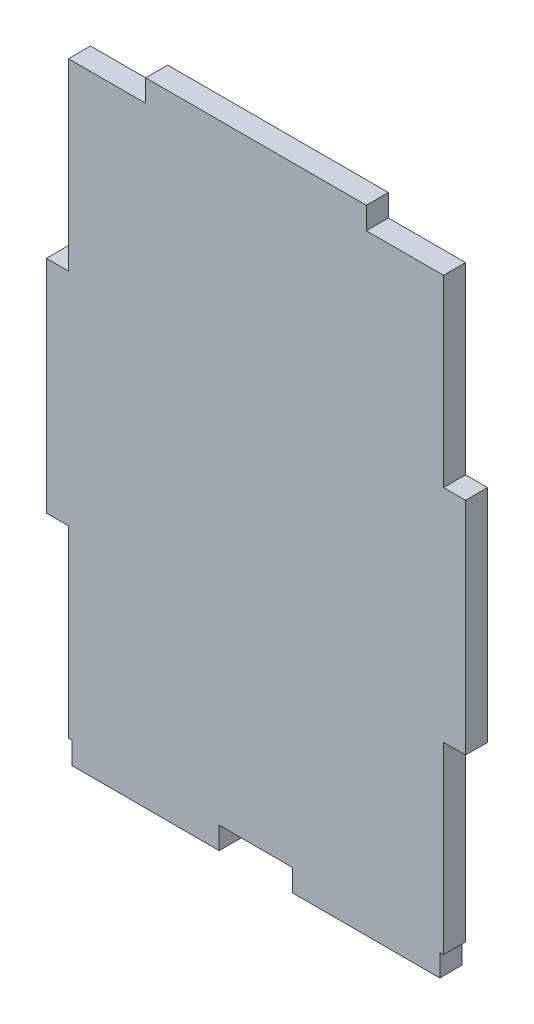
ISO-10303-21;
HEADER;
FILE_DESCRIPTION(('STEP AP214'),'2;1');
FILE_NAME('part.step','',(''),(''),'','','');
FILE_SCHEMA(('AUTOMOTIVE_DESIGN { 1 0 10303 214 1 1 1 1 }'));
ENDSEC;
DATA;
#1=APPLICATION_CONTEXT('core data for automotive mechanical design processes');
#2=APPLICATION_PROTOCOL_DEFINITION('international standard','automotive_design',2000,#1);
#3=PRODUCT_CONTEXT('',#1,'mechanical');
#4=PRODUCT('Part','Part','',(#3));
#5=PRODUCT_RELATED_PRODUCT_CATEGORY('part','',(#4));
#6=PRODUCT_DEFINITION_FORMATION('','',#4);
#7=PRODUCT_DEFINITION_CONTEXT('part definition',#1,'design');
#8=PRODUCT_DEFINITION('design','',#6,#7);
#9=PRODUCT_DEFINITION_SHAPE('','',#8);
#10=(LENGTH_UNIT() NAMED_UNIT(*) SI_UNIT(.MILLI.,.METRE.));
#11=(NAMED_UNIT(*) PLANE_ANGLE_UNIT() SI_UNIT($,.RADIAN.));
#12=(NAMED_UNIT(*) SI_UNIT($,.STERADIAN.) SOLID_ANGLE_UNIT());
#13=UNCERTAINTY_MEASURE_WITH_UNIT(LENGTH_MEASURE(1.E-05),#10,'distance_accuracy_value','');
#14=(GEOMETRIC_REPRESENTATION_CONTEXT(3) GLOBAL_UNCERTAINTY_ASSIGNED_CONTEXT((#13)) GLOBAL_UNIT_ASSIGNED_CONTEXT((#10,
#11,#12)) REPRESENTATION_CONTEXT('',''));
#15=CARTESIAN_POINT('',(0.,0.,0.));
#16=DIRECTION('',(0.,0.,1.));
#17=DIRECTION('',(1.,0.,0.));
#18=AXIS2_PLACEMENT_3D('',#15,#16,#17);
#19=CARTESIAN_POINT('',(25.5,15.,1.5));
#20=DIRECTION('',(-1.,0.,0.));
#21=DIRECTION('',(0.,0.,1.));
#22=AXIS2_PLACEMENT_3D('',#19,#20,#21);
#23=PLANE('',#22);
#24=DIRECTION('',(0.,1.,0.));
#25=VECTOR('',#24,1.);
#26=CARTESIAN_POINT('',(25.5,15.,-1.5));
#27=LINE('',#26,#25);
#28=CARTESIAN_POINT('',(25.5,15.,-1.5));
#29=VERTEX_POINT('',#28);
#30=CARTESIAN_POINT('',(25.5,40.,-1.5));
#31=VERTEX_POINT('',#30);
#32=EDGE_CURVE('E225',#29,#31,#27,.T.);
#33=ORIENTED_EDGE('',*,*,#32,.T.);
#34=DIRECTION('',(0.,0.,-1.));
#35=VECTOR('',#34,1.);
#36=CARTESIAN_POINT('',(25.5,40.,1.5));
#37=LINE('',#36,#35);
#38=CARTESIAN_POINT('',(25.5,40.,1.5));
#39=VERTEX_POINT('',#38);
#40=EDGE_CURVE('E11',#39,#31,#37,.T.);
#41=ORIENTED_EDGE('',*,*,#40,.F.);
#42=DIRECTION('',(0.,1.,0.));
#43=VECTOR('',#42,1.);
#44=CARTESIAN_POINT('',(25.5,15.,1.5));
#45=LINE('',#44,#43);
#46=CARTESIAN_POINT('',(25.5,15.,1.5));
#47=VERTEX_POINT('',#46);
#48=EDGE_CURVE('E271',#47,#39,#45,.T.);
#49=ORIENTED_EDGE('',*,*,#48,.F.);
#50=DIRECTION('',(0.,0.,-1.));
#51=VECTOR('',#50,1.);
#52=CARTESIAN_POINT('',(25.5,15.,1.5));
#53=LINE('',#52,#51);
#54=EDGE_CURVE('E221',#47,#29,#53,.T.);
#55=ORIENTED_EDGE('',*,*,#54,.T.);
#56=EDGE_LOOP('',(#33,#41,#49,#55));
#57=FACE_BOUND('',#56,.T.);
#58=ADVANCED_FACE('F33',(#57),#23,.F.);
#59=CARTESIAN_POINT('',(15.,40.,1.5));
#60=DIRECTION('',(0.,-1.,0.));
#61=DIRECTION('',(0.,0.,-1.));
#62=AXIS2_PLACEMENT_3D('',#59,#60,#61);
#63=PLANE('',#62);
#64=DIRECTION('',(-1.,0.,0.));
#65=VECTOR('',#64,1.);
#66=CARTESIAN_POINT('',(15.,40.,-1.5));
#67=LINE('',#66,#65);
#68=CARTESIAN_POINT('',(15.,40.,-1.5));
#69=VERTEX_POINT('',#68);
#70=EDGE_CURVE('E228',#31,#69,#67,.T.);
#71=ORIENTED_EDGE('',*,*,#70,.T.);
#72=DIRECTION('',(0.,0.,-1.));
#73=VECTOR('',#72,1.);
#74=CARTESIAN_POINT('',(15.,40.,1.5));
#75=LINE('',#74,#73);
#76=CARTESIAN_POINT('',(15.,40.,1.5));
#77=VERTEX_POINT('',#76);
#78=EDGE_CURVE('E41',#77,#69,#75,.T.);
#79=ORIENTED_EDGE('',*,*,#78,.F.);
#80=DIRECTION('',(-1.,0.,0.));
#81=VECTOR('',#80,1.);
#82=CARTESIAN_POINT('',(15.,40.,1.5));
#83=LINE('',#82,#81);
#84=EDGE_CURVE('E140',#39,#77,#83,.T.);
#85=ORIENTED_EDGE('',*,*,#84,.F.);
#86=ORIENTED_EDGE('',*,*,#40,.T.);
#87=EDGE_LOOP('',(#71,#79,#85,#86));
#88=FACE_BOUND('',#87,.T.);
#89=ADVANCED_FACE('F409',(#88),#63,.F.);
#90=CARTESIAN_POINT('',(15.,40.,1.5));
#91=DIRECTION('',(-1.,0.,0.));
#92=DIRECTION('',(0.,0.,1.));
#93=AXIS2_PLACEMENT_3D('',#90,#91,#92);
#94=PLANE('',#93);
#95=DIRECTION('',(0.,1.,0.));
#96=VECTOR('',#95,1.);
#97=CARTESIAN_POINT('',(15.,40.,-1.5));
#98=LINE('',#97,#96);
#99=CARTESIAN_POINT('',(15.,43.,-1.5));
#100=VERTEX_POINT('',#99);
#101=EDGE_CURVE('E230',#69,#100,#98,.T.);
#102=ORIENTED_EDGE('',*,*,#101,.T.);
#103=DIRECTION('',(0.,0.,-1.));
#104=VECTOR('',#103,1.);
#105=CARTESIAN_POINT('',(15.,43.,1.5));
#106=LINE('',#105,#104);
#107=CARTESIAN_POINT('',(15.,43.,1.5));
#108=VERTEX_POINT('',#107);
#109=EDGE_CURVE('E326',#108,#100,#106,.T.);
#110=ORIENTED_EDGE('',*,*,#109,.F.);
#111=DIRECTION('',(0.,1.,0.));
#112=VECTOR('',#111,1.);
#113=CARTESIAN_POINT('',(15.,40.,1.5));
#114=LINE('',#113,#112);
#115=EDGE_CURVE('E334',#77,#108,#114,.T.);
#116=ORIENTED_EDGE('',*,*,#115,.F.);
#117=ORIENTED_EDGE('',*,*,#78,.T.);
#118=EDGE_LOOP('',(#102,#110,#116,#117));
#119=FACE_BOUND('',#118,.T.);
#120=ADVANCED_FACE('F332',(#119),#94,.F.);
#121=CARTESIAN_POINT('',(-15.,43.,1.5));
#122=DIRECTION('',(0.,-1.,0.));
#123=DIRECTION('',(0.,0.,-1.));
#124=AXIS2_PLACEMENT_3D('',#121,#122,#123);
#125=PLANE('',#124);
#126=DIRECTION('',(-1.,0.,0.));
#127=VECTOR('',#126,1.);
#128=CARTESIAN_POINT('',(-15.,43.,-1.5));
#129=LINE('',#128,#127);
#130=CARTESIAN_POINT('',(-15.,43.,-1.5));
#131=VERTEX_POINT('',#130);
#132=EDGE_CURVE('E232',#100,#131,#129,.T.);
#133=ORIENTED_EDGE('',*,*,#132,.T.);
#134=DIRECTION('',(0.,0.,-1.));
#135=VECTOR('',#134,1.);
#136=CARTESIAN_POINT('',(-15.,43.,1.5));
#137=LINE('',#136,#135);
#138=CARTESIAN_POINT('',(-15.,43.,1.5));
#139=VERTEX_POINT('',#138);
#140=EDGE_CURVE('E323',#139,#131,#137,.T.);
#141=ORIENTED_EDGE('',*,*,#140,.F.);
#142=DIRECTION('',(-1.,0.,0.));
#143=VECTOR('',#142,1.);
#144=CARTESIAN_POINT('',(-15.,43.,1.5));
#145=LINE('',#144,#143);
#146=EDGE_CURVE('E352',#108,#139,#145,.T.);
#147=ORIENTED_EDGE('',*,*,#146,.F.);
#148=ORIENTED_EDGE('',*,*,#109,.T.);
#149=EDGE_LOOP('',(#133,#141,#147,#148));
#150=FACE_BOUND('',#149,.T.);
#151=ADVANCED_FACE('F343',(#150),#125,.F.);
#152=CARTESIAN_POINT('',(-15.,40.,1.5));
#153=DIRECTION('',(1.,0.,0.));
#154=DIRECTION('',(0.,0.,-1.));
#155=AXIS2_PLACEMENT_3D('',#152,#153,#154);
#156=PLANE('',#155);
#157=DIRECTION('',(0.,-1.,0.));
#158=VECTOR('',#157,1.);
#159=CARTESIAN_POINT('',(-15.,40.,-1.5));
#160=LINE('',#159,#158);
#161=CARTESIAN_POINT('',(-15.,40.,-1.5));
#162=VERTEX_POINT('',#161);
#163=EDGE_CURVE('E234',#131,#162,#160,.T.);
#164=ORIENTED_EDGE('',*,*,#163,.T.);
#165=DIRECTION('',(0.,0.,-1.));
#166=VECTOR('',#165,1.);
#167=CARTESIAN_POINT('',(-15.,40.,1.5));
#168=LINE('',#167,#166);
#169=CARTESIAN_POINT('',(-15.,40.,1.5));
#170=VERTEX_POINT('',#169);
#171=EDGE_CURVE('E320',#170,#162,#168,.T.);
#172=ORIENTED_EDGE('',*,*,#171,.F.);
#173=DIRECTION('',(0.,-1.,0.));
#174=VECTOR('',#173,1.);
#175=CARTESIAN_POINT('',(-15.,40.,1.5));
#176=LINE('',#175,#174);
#177=EDGE_CURVE('E349',#139,#170,#176,.T.);
#178=ORIENTED_EDGE('',*,*,#177,.F.);
#179=ORIENTED_EDGE('',*,*,#140,.T.);
#180=EDGE_LOOP('',(#164,#172,#178,#179));
#181=FACE_BOUND('',#180,.T.);
#182=ADVANCED_FACE('F347',(#181),#156,.F.);
#183=CARTESIAN_POINT('',(-25.5,40.,1.5));
#184=DIRECTION('',(0.,-1.,0.));
#185=DIRECTION('',(0.,0.,-1.));
#186=AXIS2_PLACEMENT_3D('',#183,#184,#185);
#187=PLANE('',#186);
#188=DIRECTION('',(-1.,0.,0.));
#189=VECTOR('',#188,1.);
#190=CARTESIAN_POINT('',(-25.5,40.,-1.5));
#191=LINE('',#190,#189);
#192=CARTESIAN_POINT('',(-25.5,40.,-1.5));
#193=VERTEX_POINT('',#192);
#194=EDGE_CURVE('E236',#162,#193,#191,.T.);
#195=ORIENTED_EDGE('',*,*,#194,.T.);
#196=DIRECTION('',(0.,0.,-1.));
#197=VECTOR('',#196,1.);
#198=CARTESIAN_POINT('',(-25.5,40.,1.5));
#199=LINE('',#198,#197);
#200=CARTESIAN_POINT('',(-25.5,40.,1.5));
#201=VERTEX_POINT('',#200);
#202=EDGE_CURVE('E317',#201,#193,#199,.T.);
#203=ORIENTED_EDGE('',*,*,#202,.F.);
#204=DIRECTION('',(-1.,0.,0.));
#205=VECTOR('',#204,1.);
#206=CARTESIAN_POINT('',(-25.5,40.,1.5));
#207=LINE('',#206,#205);
#208=EDGE_CURVE('E351',#170,#201,#207,.T.);
#209=ORIENTED_EDGE('',*,*,#208,.F.);
#210=ORIENTED_EDGE('',*,*,#171,.T.);
#211=EDGE_LOOP('',(#195,#203,#209,#210));
#212=FACE_BOUND('',#211,.T.);
#213=ADVANCED_FACE('F422',(#212),#187,.F.);
#214=CARTESIAN_POINT('',(-25.5,15.,1.5));
#215=DIRECTION('',(1.,0.,0.));
#216=DIRECTION('',(0.,0.,-1.));
#217=AXIS2_PLACEMENT_3D('',#214,#215,#216);
#218=PLANE('',#217);
#219=DIRECTION('',(0.,-1.,0.));
#220=VECTOR('',#219,1.);
#221=CARTESIAN_POINT('',(-25.5,15.,-1.5));
#222=LINE('',#221,#220);
#223=CARTESIAN_POINT('',(-25.5,15.,-1.5));
#224=VERTEX_POINT('',#223);
#225=EDGE_CURVE('E238',#193,#224,#222,.T.);
#226=ORIENTED_EDGE('',*,*,#225,.T.);
#227=DIRECTION('',(0.,0.,-1.));
#228=VECTOR('',#227,1.);
#229=CARTESIAN_POINT('',(-25.5,15.,1.5));
#230=LINE('',#229,#228);
#231=CARTESIAN_POINT('',(-25.5,15.,1.5));
#232=VERTEX_POINT('',#231);
#233=EDGE_CURVE('E314',#232,#224,#230,.T.);
#234=ORIENTED_EDGE('',*,*,#233,.F.);
#235=DIRECTION('',(0.,-1.,0.));
#236=VECTOR('',#235,1.);
#237=CARTESIAN_POINT('',(-25.5,15.,1.5));
#238=LINE('',#237,#236);
#239=EDGE_CURVE('E354',#201,#232,#238,.T.);
#240=ORIENTED_EDGE('',*,*,#239,.F.);
#241=ORIENTED_EDGE('',*,*,#202,.T.);
#242=EDGE_LOOP('',(#226,#234,#240,#241));
#243=FACE_BOUND('',#242,.T.);
#244=ADVANCED_FACE('F425',(#243),#218,.F.);
#245=CARTESIAN_POINT('',(-25.5,15.,1.5));
#246=DIRECTION('',(0.,-1.,0.));
#247=DIRECTION('',(0.,0.,-1.));
#248=AXIS2_PLACEMENT_3D('',#245,#246,#247);
#249=PLANE('',#248);
#250=DIRECTION('',(-1.,0.,0.));
#251=VECTOR('',#250,1.);
#252=CARTESIAN_POINT('',(-25.5,15.,-1.5));
#253=LINE('',#252,#251);
#254=CARTESIAN_POINT('',(-28.5,15.,-1.5));
#255=VERTEX_POINT('',#254);
#256=EDGE_CURVE('E240',#224,#255,#253,.T.);
#257=ORIENTED_EDGE('',*,*,#256,.T.);
#258=DIRECTION('',(0.,0.,-1.));
#259=VECTOR('',#258,1.);
#260=CARTESIAN_POINT('',(-28.5,15.,1.5));
#261=LINE('',#260,#259);
#262=CARTESIAN_POINT('',(-28.5,15.,1.5));
#263=VERTEX_POINT('',#262);
#264=EDGE_CURVE('E311',#263,#255,#261,.T.);
#265=ORIENTED_EDGE('',*,*,#264,.F.);
#266=DIRECTION('',(-1.,0.,0.));
#267=VECTOR('',#266,1.);
#268=CARTESIAN_POINT('',(-25.5,15.,1.5));
#269=LINE('',#268,#267);
#270=EDGE_CURVE('E360',#232,#263,#269,.T.);
#271=ORIENTED_EDGE('',*,*,#270,.F.);
#272=ORIENTED_EDGE('',*,*,#233,.T.);
#273=EDGE_LOOP('',(#257,#265,#271,#272));
#274=FACE_BOUND('',#273,.T.);
#275=ADVANCED_FACE('F429',(#274),#249,.F.);
#276=CARTESIAN_POINT('',(-28.5,15.,1.5));
#277=DIRECTION('',(1.,0.,0.));
#278=DIRECTION('',(0.,1.,0.));
#279=AXIS2_PLACEMENT_3D('',#276,#277,#278);
#280=PLANE('',#279);
#281=DIRECTION('',(0.,-1.,0.));
#282=VECTOR('',#281,1.);
#283=CARTESIAN_POINT('',(-28.5,15.,-1.5));
#284=LINE('',#283,#282);
#285=CARTESIAN_POINT('',(-28.5,-15.,-1.5));
#286=VERTEX_POINT('',#285);
#287=EDGE_CURVE('E242',#255,#286,#284,.T.);
#288=ORIENTED_EDGE('',*,*,#287,.T.);
#289=DIRECTION('',(0.,0.,-1.));
#290=VECTOR('',#289,1.);
#291=CARTESIAN_POINT('',(-28.5,-15.,1.5));
#292=LINE('',#291,#290);
#293=CARTESIAN_POINT('',(-28.5,-15.,1.5));
#294=VERTEX_POINT('',#293);
#295=EDGE_CURVE('E308',#294,#286,#292,.T.);
#296=ORIENTED_EDGE('',*,*,#295,.F.);
#297=DIRECTION('',(0.,-1.,0.));
#298=VECTOR('',#297,1.);
#299=CARTESIAN_POINT('',(-28.5,15.,1.5));
#300=LINE('',#299,#298);
#301=EDGE_CURVE('E362',#263,#294,#300,.T.);
#302=ORIENTED_EDGE('',*,*,#301,.F.);
#303=ORIENTED_EDGE('',*,*,#264,.T.);
#304=EDGE_LOOP('',(#288,#296,#302,#303));
#305=FACE_BOUND('',#304,.T.);
#306=ADVANCED_FACE('F433',(#305),#280,.F.);
#307=CARTESIAN_POINT('',(-25.5,-15.,1.5));
#308=DIRECTION('',(0.,1.,0.));
#309=DIRECTION('',(0.,0.,1.));
#310=AXIS2_PLACEMENT_3D('',#307,#308,#309);
#311=PLANE('',#310);
#312=DIRECTION('',(1.,0.,0.));
#313=VECTOR('',#312,1.);
#314=CARTESIAN_POINT('',(-25.5,-15.,-1.5));
#315=LINE('',#314,#313);
#316=CARTESIAN_POINT('',(-25.5,-15.,-1.5));
#317=VERTEX_POINT('',#316);
#318=EDGE_CURVE('E244',#286,#317,#315,.T.);
#319=ORIENTED_EDGE('',*,*,#318,.T.);
#320=DIRECTION('',(0.,0.,-1.));
#321=VECTOR('',#320,1.);
#322=CARTESIAN_POINT('',(-25.5,-15.,1.5));
#323=LINE('',#322,#321);
#324=CARTESIAN_POINT('',(-25.5,-15.,1.5));
#325=VERTEX_POINT('',#324);
#326=EDGE_CURVE('E305',#325,#317,#323,.T.);
#327=ORIENTED_EDGE('',*,*,#326,.F.);
#328=DIRECTION('',(1.,0.,0.));
#329=VECTOR('',#328,1.);
#330=CARTESIAN_POINT('',(-25.5,-15.,1.5));
#331=LINE('',#330,#329);
#332=EDGE_CURVE('E364',#294,#325,#331,.T.);
#333=ORIENTED_EDGE('',*,*,#332,.F.);
#334=ORIENTED_EDGE('',*,*,#295,.T.);
#335=EDGE_LOOP('',(#319,#327,#333,#334));
#336=FACE_BOUND('',#335,.T.);
#337=ADVANCED_FACE('F437',(#336),#311,.F.);
#338=CARTESIAN_POINT('',(-25.5,-40.,1.5));
#339=DIRECTION('',(1.,0.,0.));
#340=DIRECTION('',(0.,0.,-1.));
#341=AXIS2_PLACEMENT_3D('',#338,#339,#340);
#342=PLANE('',#341);
#343=DIRECTION('',(0.,-1.,0.));
#344=VECTOR('',#343,1.);
#345=CARTESIAN_POINT('',(-25.5,-40.,-1.5));
#346=LINE('',#345,#344);
#347=CARTESIAN_POINT('',(-25.5,-40.,-1.5));
#348=VERTEX_POINT('',#347);
#349=EDGE_CURVE('E246',#317,#348,#346,.T.);
#350=ORIENTED_EDGE('',*,*,#349,.T.);
#351=DIRECTION('',(0.,0.,-1.));
#352=VECTOR('',#351,1.);
#353=CARTESIAN_POINT('',(-25.5,-40.,1.5));
#354=LINE('',#353,#352);
#355=CARTESIAN_POINT('',(-25.5,-40.,1.5));
#356=VERTEX_POINT('',#355);
#357=EDGE_CURVE('E302',#356,#348,#354,.T.);
#358=ORIENTED_EDGE('',*,*,#357,.F.);
#359=DIRECTION('',(0.,-1.,0.));
#360=VECTOR('',#359,1.);
#361=CARTESIAN_POINT('',(-25.5,-40.,1.5));
#362=LINE('',#361,#360);
#363=EDGE_CURVE('E366',#325,#356,#362,.T.);
#364=ORIENTED_EDGE('',*,*,#363,.F.);
#365=ORIENTED_EDGE('',*,*,#326,.T.);
#366=EDGE_LOOP('',(#350,#358,#364,#365));
#367=FACE_BOUND('',#366,.T.);
#368=ADVANCED_FACE('F441',(#367),#342,.F.);
#369=CARTESIAN_POINT('',(-25.5,-40.,1.5));
#370=DIRECTION('',(0.,1.,0.));
#371=DIRECTION('',(0.,0.,1.));
#372=AXIS2_PLACEMENT_3D('',#369,#370,#371);
#373=PLANE('',#372);
#374=DIRECTION('',(1.,0.,0.));
#375=VECTOR('',#374,1.);
#376=CARTESIAN_POINT('',(-25.5,-40.,-1.5));
#377=LINE('',#376,#375);
#378=CARTESIAN_POINT('',(-25.,-40.,-1.5));
#379=VERTEX_POINT('',#378);
#380=EDGE_CURVE('E248',#348,#379,#377,.T.);
#381=ORIENTED_EDGE('',*,*,#380,.T.);
#382=DIRECTION('',(0.,0.,-1.));
#383=VECTOR('',#382,1.);
#384=CARTESIAN_POINT('',(-25.,-40.,1.5));
#385=LINE('',#384,#383);
#386=CARTESIAN_POINT('',(-25.,-40.,1.5));
#387=VERTEX_POINT('',#386);
#388=EDGE_CURVE('E299',#387,#379,#385,.T.);
#389=ORIENTED_EDGE('',*,*,#388,.F.);
#390=DIRECTION('',(1.,0.,0.));
#391=VECTOR('',#390,1.);
#392=CARTESIAN_POINT('',(-25.5,-40.,1.5));
#393=LINE('',#392,#391);
#394=EDGE_CURVE('E368',#356,#387,#393,.T.);
#395=ORIENTED_EDGE('',*,*,#394,.F.);
#396=ORIENTED_EDGE('',*,*,#357,.T.);
#397=EDGE_LOOP('',(#381,#389,#395,#396));
#398=FACE_BOUND('',#397,.T.);
#399=ADVANCED_FACE('F445',(#398),#373,.F.);
#400=CARTESIAN_POINT('',(-25.,-40.,1.5));
#401=DIRECTION('',(1.,0.,0.));
#402=DIRECTION('',(0.,0.,-1.));
#403=AXIS2_PLACEMENT_3D('',#400,#401,#402);
#404=PLANE('',#403);
#405=DIRECTION('',(0.,-1.,0.));
#406=VECTOR('',#405,1.);
#407=CARTESIAN_POINT('',(-25.,-40.,-1.5));
#408=LINE('',#407,#406);
#409=CARTESIAN_POINT('',(-25.,-43.,-1.5));
#410=VERTEX_POINT('',#409);
#411=EDGE_CURVE('E250',#379,#410,#408,.T.);
#412=ORIENTED_EDGE('',*,*,#411,.T.);
#413=DIRECTION('',(0.,0.,-1.));
#414=VECTOR('',#413,1.);
#415=CARTESIAN_POINT('',(-25.,-43.,1.5));
#416=LINE('',#415,#414);
#417=CARTESIAN_POINT('',(-25.,-43.,1.5));
#418=VERTEX_POINT('',#417);
#419=EDGE_CURVE('E296',#418,#410,#416,.T.);
#420=ORIENTED_EDGE('',*,*,#419,.F.);
#421=DIRECTION('',(0.,-1.,0.));
#422=VECTOR('',#421,1.);
#423=CARTESIAN_POINT('',(-25.,-40.,1.5));
#424=LINE('',#423,#422);
#425=EDGE_CURVE('E370',#387,#418,#424,.T.);
#426=ORIENTED_EDGE('',*,*,#425,.F.);
#427=ORIENTED_EDGE('',*,*,#388,.T.);
#428=EDGE_LOOP('',(#412,#420,#426,#427));
#429=FACE_BOUND('',#428,.T.);
#430=ADVANCED_FACE('F449',(#429),#404,.F.);
#431=CARTESIAN_POINT('',(-25.,-43.,1.5));
#432=DIRECTION('',(0.,1.,0.));
#433=DIRECTION('',(0.,0.,1.));
#434=AXIS2_PLACEMENT_3D('',#431,#432,#433);
#435=PLANE('',#434);
#436=DIRECTION('',(1.,0.,0.));
#437=VECTOR('',#436,1.);
#438=CARTESIAN_POINT('',(-25.,-43.,-1.5));
#439=LINE('',#438,#437);
#440=CARTESIAN_POINT('',(-4.99999999999999,-43.,-1.5));
#441=VERTEX_POINT('',#440);
#442=EDGE_CURVE('E252',#410,#441,#439,.T.);
#443=ORIENTED_EDGE('',*,*,#442,.T.);
#444=DIRECTION('',(0.,0.,-1.));
#445=VECTOR('',#444,1.);
#446=CARTESIAN_POINT('',(-4.99999999999999,-43.,1.5));
#447=LINE('',#446,#445);
#448=CARTESIAN_POINT('',(-4.99999999999999,-43.,1.5));
#449=VERTEX_POINT('',#448);
#450=EDGE_CURVE('E293',#449,#441,#447,.T.);
#451=ORIENTED_EDGE('',*,*,#450,.F.);
#452=DIRECTION('',(1.,0.,0.));
#453=VECTOR('',#452,1.);
#454=CARTESIAN_POINT('',(-25.,-43.,1.5));
#455=LINE('',#454,#453);
#456=EDGE_CURVE('E372',#418,#449,#455,.T.);
#457=ORIENTED_EDGE('',*,*,#456,.F.);
#458=ORIENTED_EDGE('',*,*,#419,.T.);
#459=EDGE_LOOP('',(#443,#451,#457,#458));
#460=FACE_BOUND('',#459,.T.);
#461=ADVANCED_FACE('F453',(#460),#435,.F.);
#462=CARTESIAN_POINT('',(-4.99999999999999,-40.,1.5));
#463=DIRECTION('',(-1.,0.,0.));
#464=DIRECTION('',(0.,0.,1.));
#465=AXIS2_PLACEMENT_3D('',#462,#463,#464);
#466=PLANE('',#465);
#467=DIRECTION('',(0.,1.,0.));
#468=VECTOR('',#467,1.);
#469=CARTESIAN_POINT('',(-4.99999999999999,-40.,-1.5));
#470=LINE('',#469,#468);
#471=CARTESIAN_POINT('',(-4.99999999999999,-40.,-1.5));
#472=VERTEX_POINT('',#471);
#473=EDGE_CURVE('E254',#441,#472,#470,.T.);
#474=ORIENTED_EDGE('',*,*,#473,.T.);
#475=DIRECTION('',(0.,0.,-1.));
#476=VECTOR('',#475,1.);
#477=CARTESIAN_POINT('',(-4.99999999999999,-40.,1.5));
#478=LINE('',#477,#476);
#479=CARTESIAN_POINT('',(-4.99999999999999,-40.,1.5));
#480=VERTEX_POINT('',#479);
#481=EDGE_CURVE('E290',#480,#472,#478,.T.);
#482=ORIENTED_EDGE('',*,*,#481,.F.);
#483=DIRECTION('',(0.,1.,0.));
#484=VECTOR('',#483,1.);
#485=CARTESIAN_POINT('',(-4.99999999999999,-40.,1.5));
#486=LINE('',#485,#484);
#487=EDGE_CURVE('E374',#449,#480,#486,.T.);
#488=ORIENTED_EDGE('',*,*,#487,.F.);
#489=ORIENTED_EDGE('',*,*,#450,.T.);
#490=EDGE_LOOP('',(#474,#482,#488,#489));
#491=FACE_BOUND('',#490,.T.);
#492=ADVANCED_FACE('F457',(#491),#466,.F.);
#493=CARTESIAN_POINT('',(-4.99999999999999,-40.,1.5));
#494=DIRECTION('',(0.,1.,0.));
#495=DIRECTION('',(0.,0.,1.));
#496=AXIS2_PLACEMENT_3D('',#493,#494,#495);
#497=PLANE('',#496);
#498=DIRECTION('',(1.,0.,0.));
#499=VECTOR('',#498,1.);
#500=CARTESIAN_POINT('',(-4.99999999999999,-40.,-1.5));
#501=LINE('',#500,#499);
#502=CARTESIAN_POINT('',(5.,-40.,-1.5));
#503=VERTEX_POINT('',#502);
#504=EDGE_CURVE('E256',#472,#503,#501,.T.);
#505=ORIENTED_EDGE('',*,*,#504,.T.);
#506=DIRECTION('',(0.,0.,-1.));
#507=VECTOR('',#506,1.);
#508=CARTESIAN_POINT('',(5.,-40.,1.5));
#509=LINE('',#508,#507);
#510=CARTESIAN_POINT('',(5.,-40.,1.5));
#511=VERTEX_POINT('',#510);
#512=EDGE_CURVE('E287',#511,#503,#509,.T.);
#513=ORIENTED_EDGE('',*,*,#512,.F.);
#514=DIRECTION('',(1.,0.,0.));
#515=VECTOR('',#514,1.);
#516=CARTESIAN_POINT('',(-4.99999999999999,-40.,1.5));
#517=LINE('',#516,#515);
#518=EDGE_CURVE('E376',#480,#511,#517,.T.);
#519=ORIENTED_EDGE('',*,*,#518,.F.);
#520=ORIENTED_EDGE('',*,*,#481,.T.);
#521=EDGE_LOOP('',(#505,#513,#519,#520));
#522=FACE_BOUND('',#521,.T.);
#523=ADVANCED_FACE('F461',(#522),#497,.F.);
#524=CARTESIAN_POINT('',(5.,-40.,1.5));
#525=DIRECTION('',(1.,0.,0.));
#526=DIRECTION('',(0.,0.,-1.));
#527=AXIS2_PLACEMENT_3D('',#524,#525,#526);
#528=PLANE('',#527);
#529=DIRECTION('',(0.,-1.,0.));
#530=VECTOR('',#529,1.);
#531=CARTESIAN_POINT('',(5.,-40.,-1.5));
#532=LINE('',#531,#530);
#533=CARTESIAN_POINT('',(5.,-43.,-1.5));
#534=VERTEX_POINT('',#533);
#535=EDGE_CURVE('E258',#503,#534,#532,.T.);
#536=ORIENTED_EDGE('',*,*,#535,.T.);
#537=DIRECTION('',(0.,0.,-1.));
#538=VECTOR('',#537,1.);
#539=CARTESIAN_POINT('',(5.,-43.,1.5));
#540=LINE('',#539,#538);
#541=CARTESIAN_POINT('',(5.,-43.,1.5));
#542=VERTEX_POINT('',#541);
#543=EDGE_CURVE('E284',#542,#534,#540,.T.);
#544=ORIENTED_EDGE('',*,*,#543,.F.);
#545=DIRECTION('',(0.,-1.,0.));
#546=VECTOR('',#545,1.);
#547=CARTESIAN_POINT('',(5.,-40.,1.5));
#548=LINE('',#547,#546);
#549=EDGE_CURVE('E378',#511,#542,#548,.T.);
#550=ORIENTED_EDGE('',*,*,#549,.F.);
#551=ORIENTED_EDGE('',*,*,#512,.T.);
#552=EDGE_LOOP('',(#536,#544,#550,#551));
#553=FACE_BOUND('',#552,.T.);
#554=ADVANCED_FACE('F465',(#553),#528,.F.);
#555=CARTESIAN_POINT('',(5.,-43.,1.5));
#556=DIRECTION('',(0.,1.,0.));
#557=DIRECTION('',(0.,0.,1.));
#558=AXIS2_PLACEMENT_3D('',#555,#556,#557);
#559=PLANE('',#558);
#560=DIRECTION('',(1.,0.,0.));
#561=VECTOR('',#560,1.);
#562=CARTESIAN_POINT('',(5.,-43.,-1.5));
#563=LINE('',#562,#561);
#564=CARTESIAN_POINT('',(25.,-43.,-1.5));
#565=VERTEX_POINT('',#564);
#566=EDGE_CURVE('E260',#534,#565,#563,.T.);
#567=ORIENTED_EDGE('',*,*,#566,.T.);
#568=DIRECTION('',(0.,0.,-1.));
#569=VECTOR('',#568,1.);
#570=CARTESIAN_POINT('',(25.,-43.,1.5));
#571=LINE('',#570,#569);
#572=CARTESIAN_POINT('',(25.,-43.,1.5));
#573=VERTEX_POINT('',#572);
#574=EDGE_CURVE('E281',#573,#565,#571,.T.);
#575=ORIENTED_EDGE('',*,*,#574,.F.);
#576=DIRECTION('',(1.,0.,0.));
#577=VECTOR('',#576,1.);
#578=CARTESIAN_POINT('',(5.,-43.,1.5));
#579=LINE('',#578,#577);
#580=EDGE_CURVE('E380',#542,#573,#579,.T.);
#581=ORIENTED_EDGE('',*,*,#580,.F.);
#582=ORIENTED_EDGE('',*,*,#543,.T.);
#583=EDGE_LOOP('',(#567,#575,#581,#582));
#584=FACE_BOUND('',#583,.T.);
#585=ADVANCED_FACE('F469',(#584),#559,.F.);
#586=CARTESIAN_POINT('',(25.,-40.,1.5));
#587=DIRECTION('',(-1.,0.,0.));
#588=DIRECTION('',(0.,0.,1.));
#589=AXIS2_PLACEMENT_3D('',#586,#587,#588);
#590=PLANE('',#589);
#591=DIRECTION('',(0.,1.,0.));
#592=VECTOR('',#591,1.);
#593=CARTESIAN_POINT('',(25.,-40.,-1.5));
#594=LINE('',#593,#592);
#595=CARTESIAN_POINT('',(25.,-40.,-1.5));
#596=VERTEX_POINT('',#595);
#597=EDGE_CURVE('E262',#565,#596,#594,.T.);
#598=ORIENTED_EDGE('',*,*,#597,.T.);
#599=DIRECTION('',(0.,0.,-1.));
#600=VECTOR('',#599,1.);
#601=CARTESIAN_POINT('',(25.,-40.,1.5));
#602=LINE('',#601,#600);
#603=CARTESIAN_POINT('',(25.,-40.,1.5));
#604=VERTEX_POINT('',#603);
#605=EDGE_CURVE('E278',#604,#596,#602,.T.);
#606=ORIENTED_EDGE('',*,*,#605,.F.);
#607=DIRECTION('',(0.,1.,0.));
#608=VECTOR('',#607,1.);
#609=CARTESIAN_POINT('',(25.,-40.,1.5));
#610=LINE('',#609,#608);
#611=EDGE_CURVE('E382',#573,#604,#610,.T.);
#612=ORIENTED_EDGE('',*,*,#611,.F.);
#613=ORIENTED_EDGE('',*,*,#574,.T.);
#614=EDGE_LOOP('',(#598,#606,#612,#613));
#615=FACE_BOUND('',#614,.T.);
#616=ADVANCED_FACE('F473',(#615),#590,.F.);
#617=CARTESIAN_POINT('',(25.,-40.,1.5));
#618=DIRECTION('',(0.,1.,0.));
#619=DIRECTION('',(0.,0.,1.));
#620=AXIS2_PLACEMENT_3D('',#617,#618,#619);
#621=PLANE('',#620);
#622=DIRECTION('',(1.,0.,0.));
#623=VECTOR('',#622,1.);
#624=CARTESIAN_POINT('',(25.,-40.,-1.5));
#625=LINE('',#624,#623);
#626=CARTESIAN_POINT('',(25.5,-40.,-1.5));
#627=VERTEX_POINT('',#626);
#628=EDGE_CURVE('E264',#596,#627,#625,.T.);
#629=ORIENTED_EDGE('',*,*,#628,.T.);
#630=DIRECTION('',(0.,0.,-1.));
#631=VECTOR('',#630,1.);
#632=CARTESIAN_POINT('',(25.5,-40.,1.5));
#633=LINE('',#632,#631);
#634=CARTESIAN_POINT('',(25.5,-40.,1.5));
#635=VERTEX_POINT('',#634);
#636=EDGE_CURVE('E275',#635,#627,#633,.T.);
#637=ORIENTED_EDGE('',*,*,#636,.F.);
#638=DIRECTION('',(1.,0.,0.));
#639=VECTOR('',#638,1.);
#640=CARTESIAN_POINT('',(25.,-40.,1.5));
#641=LINE('',#640,#639);
#642=EDGE_CURVE('E384',#604,#635,#641,.T.);
#643=ORIENTED_EDGE('',*,*,#642,.F.);
#644=ORIENTED_EDGE('',*,*,#605,.T.);
#645=EDGE_LOOP('',(#629,#637,#643,#644));
#646=FACE_BOUND('',#645,.T.);
#647=ADVANCED_FACE('F390',(#646),#621,.F.);
#648=CARTESIAN_POINT('',(25.5,-40.,1.5));
#649=DIRECTION('',(-1.,0.,0.));
#650=DIRECTION('',(0.,0.,1.));
#651=AXIS2_PLACEMENT_3D('',#648,#649,#650);
#652=PLANE('',#651);
#653=DIRECTION('',(0.,1.,0.));
#654=VECTOR('',#653,1.);
#655=CARTESIAN_POINT('',(25.5,-40.,-1.5));
#656=LINE('',#655,#654);
#657=CARTESIAN_POINT('',(25.5,-15.,-1.5));
#658=VERTEX_POINT('',#657);
#659=EDGE_CURVE('E266',#627,#658,#656,.T.);
#660=ORIENTED_EDGE('',*,*,#659,.T.);
#661=DIRECTION('',(0.,0.,-1.));
#662=VECTOR('',#661,1.);
#663=CARTESIAN_POINT('',(25.5,-15.,1.5));
#664=LINE('',#663,#662);
#665=CARTESIAN_POINT('',(25.5,-15.,1.5));
#666=VERTEX_POINT('',#665);
#667=EDGE_CURVE('E216',#666,#658,#664,.T.);
#668=ORIENTED_EDGE('',*,*,#667,.F.);
#669=DIRECTION('',(0.,1.,0.));
#670=VECTOR('',#669,1.);
#671=CARTESIAN_POINT('',(25.5,-40.,1.5));
#672=LINE('',#671,#670);
#673=EDGE_CURVE('E207',#635,#666,#672,.T.);
#674=ORIENTED_EDGE('',*,*,#673,.F.);
#675=ORIENTED_EDGE('',*,*,#636,.T.);
#676=EDGE_LOOP('',(#660,#668,#674,#675));
#677=FACE_BOUND('',#676,.T.);
#678=ADVANCED_FACE('F394',(#677),#652,.F.);
#679=CARTESIAN_POINT('',(25.5,-15.,1.5));
#680=DIRECTION('',(0.,1.,0.));
#681=DIRECTION('',(0.,0.,1.));
#682=AXIS2_PLACEMENT_3D('',#679,#680,#681);
#683=PLANE('',#682);
#684=DIRECTION('',(1.,0.,0.));
#685=VECTOR('',#684,1.);
#686=CARTESIAN_POINT('',(25.5,-15.,-1.5));
#687=LINE('',#686,#685);
#688=CARTESIAN_POINT('',(28.5,-15.,-1.5));
#689=VERTEX_POINT('',#688);
#690=EDGE_CURVE('E215',#658,#689,#687,.T.);
#691=ORIENTED_EDGE('',*,*,#690,.T.);
#692=DIRECTION('',(0.,0.,-1.));
#693=VECTOR('',#692,1.);
#694=CARTESIAN_POINT('',(28.5,-15.,1.5));
#695=LINE('',#694,#693);
#696=CARTESIAN_POINT('',(28.5,-15.,1.5));
#697=VERTEX_POINT('',#696);
#698=EDGE_CURVE('E212',#697,#689,#695,.T.);
#699=ORIENTED_EDGE('',*,*,#698,.F.);
#700=DIRECTION('',(1.,0.,0.));
#701=VECTOR('',#700,1.);
#702=CARTESIAN_POINT('',(25.5,-15.,1.5));
#703=LINE('',#702,#701);
#704=EDGE_CURVE('E201',#666,#697,#703,.T.);
#705=ORIENTED_EDGE('',*,*,#704,.F.);
#706=ORIENTED_EDGE('',*,*,#667,.T.);
#707=EDGE_LOOP('',(#691,#699,#705,#706));
#708=FACE_BOUND('',#707,.T.);
#709=ADVANCED_FACE('F213',(#708),#683,.F.);
#710=CARTESIAN_POINT('',(28.5,15.,1.5));
#711=DIRECTION('',(-1.,0.,0.));
#712=DIRECTION('',(0.,-1.,0.));
#713=AXIS2_PLACEMENT_3D('',#710,#711,#712);
#714=PLANE('',#713);
#715=DIRECTION('',(0.,1.,0.));
#716=VECTOR('',#715,1.);
#717=CARTESIAN_POINT('',(28.5,15.,-1.5));
#718=LINE('',#717,#716);
#719=CARTESIAN_POINT('',(28.5,15.,-1.5));
#720=VERTEX_POINT('',#719);
#721=EDGE_CURVE('E126',#689,#720,#718,.T.);
#722=ORIENTED_EDGE('',*,*,#721,.T.);
#723=DIRECTION('',(0.,0.,-1.));
#724=VECTOR('',#723,1.);
#725=CARTESIAN_POINT('',(28.5,15.,1.5));
#726=LINE('',#725,#724);
#727=CARTESIAN_POINT('',(28.5,15.,1.5));
#728=VERTEX_POINT('',#727);
#729=EDGE_CURVE('E217',#728,#720,#726,.T.);
#730=ORIENTED_EDGE('',*,*,#729,.F.);
#731=DIRECTION('',(0.,1.,0.));
#732=VECTOR('',#731,1.);
#733=CARTESIAN_POINT('',(28.5,15.,1.5));
#734=LINE('',#733,#732);
#735=EDGE_CURVE('E205',#697,#728,#734,.T.);
#736=ORIENTED_EDGE('',*,*,#735,.F.);
#737=ORIENTED_EDGE('',*,*,#698,.T.);
#738=EDGE_LOOP('',(#722,#730,#736,#737));
#739=FACE_BOUND('',#738,.T.);
#740=ADVANCED_FACE('F219',(#739),#714,.F.);
#741=CARTESIAN_POINT('',(25.5,15.,1.5));
#742=DIRECTION('',(0.,-1.,0.));
#743=DIRECTION('',(0.,0.,-1.));
#744=AXIS2_PLACEMENT_3D('',#741,#742,#743);
#745=PLANE('',#744);
#746=DIRECTION('',(-1.,0.,0.));
#747=VECTOR('',#746,1.);
#748=CARTESIAN_POINT('',(25.5,15.,-1.5));
#749=LINE('',#748,#747);
#750=EDGE_CURVE('E132',#720,#29,#749,.T.);
#751=ORIENTED_EDGE('',*,*,#750,.T.);
#752=ORIENTED_EDGE('',*,*,#54,.F.);
#753=DIRECTION('',(-1.,0.,0.));
#754=VECTOR('',#753,1.);
#755=CARTESIAN_POINT('',(25.5,15.,1.5));
#756=LINE('',#755,#754);
#757=EDGE_CURVE('E49',#728,#47,#756,.T.);
#758=ORIENTED_EDGE('',*,*,#757,.F.);
#759=ORIENTED_EDGE('',*,*,#729,.T.);
#760=EDGE_LOOP('',(#751,#752,#758,#759));
#761=FACE_BOUND('',#760,.T.);
#762=ADVANCED_FACE('F398',(#761),#745,.F.);
#763=CARTESIAN_POINT('',(0.,0.,1.5));
#764=DIRECTION('',(0.,0.,-1.));
#765=DIRECTION('',(-1.,0.,0.));
#766=AXIS2_PLACEMENT_3D('',#763,#764,#765);
#767=PLANE('',#766);
#768=ORIENTED_EDGE('',*,*,#48,.T.);
#769=ORIENTED_EDGE('',*,*,#84,.T.);
#770=ORIENTED_EDGE('',*,*,#115,.T.);
#771=ORIENTED_EDGE('',*,*,#146,.T.);
#772=ORIENTED_EDGE('',*,*,#177,.T.);
#773=ORIENTED_EDGE('',*,*,#208,.T.);
#774=ORIENTED_EDGE('',*,*,#239,.T.);
#775=ORIENTED_EDGE('',*,*,#270,.T.);
#776=ORIENTED_EDGE('',*,*,#301,.T.);
#777=ORIENTED_EDGE('',*,*,#332,.T.);
#778=ORIENTED_EDGE('',*,*,#363,.T.);
#779=ORIENTED_EDGE('',*,*,#394,.T.);
#780=ORIENTED_EDGE('',*,*,#425,.T.);
#781=ORIENTED_EDGE('',*,*,#456,.T.);
#782=ORIENTED_EDGE('',*,*,#487,.T.);
#783=ORIENTED_EDGE('',*,*,#518,.T.);
#784=ORIENTED_EDGE('',*,*,#549,.T.);
#785=ORIENTED_EDGE('',*,*,#580,.T.);
#786=ORIENTED_EDGE('',*,*,#611,.T.);
#787=ORIENTED_EDGE('',*,*,#642,.T.);
#788=ORIENTED_EDGE('',*,*,#673,.T.);
#789=ORIENTED_EDGE('',*,*,#704,.T.);
#790=ORIENTED_EDGE('',*,*,#735,.T.);
#791=ORIENTED_EDGE('',*,*,#757,.T.);
#792=EDGE_LOOP('',(#768,#769,#770,#771,#772,#773,#774,#775,#776,#777,#778,#779,#780,#781,#782,
#783,#784,#785,#786,#787,#788,#789,#790,#791));
#793=FACE_BOUND('',#792,.T.);
#794=ADVANCED_FACE('F203',(#793),#767,.F.);
#795=CARTESIAN_POINT('',(0.,0.,-1.5));
#796=DIRECTION('',(0.,0.,-1.));
#797=DIRECTION('',(-1.,0.,0.));
#798=AXIS2_PLACEMENT_3D('',#795,#796,#797);
#799=PLANE('',#798);
#800=ORIENTED_EDGE('',*,*,#32,.F.);
#801=ORIENTED_EDGE('',*,*,#750,.F.);
#802=ORIENTED_EDGE('',*,*,#721,.F.);
#803=ORIENTED_EDGE('',*,*,#690,.F.);
#804=ORIENTED_EDGE('',*,*,#659,.F.);
#805=ORIENTED_EDGE('',*,*,#628,.F.);
#806=ORIENTED_EDGE('',*,*,#597,.F.);
#807=ORIENTED_EDGE('',*,*,#566,.F.);
#808=ORIENTED_EDGE('',*,*,#535,.F.);
#809=ORIENTED_EDGE('',*,*,#504,.F.);
#810=ORIENTED_EDGE('',*,*,#473,.F.);
#811=ORIENTED_EDGE('',*,*,#442,.F.);
#812=ORIENTED_EDGE('',*,*,#411,.F.);
#813=ORIENTED_EDGE('',*,*,#380,.F.);
#814=ORIENTED_EDGE('',*,*,#349,.F.);
#815=ORIENTED_EDGE('',*,*,#318,.F.);
#816=ORIENTED_EDGE('',*,*,#287,.F.);
#817=ORIENTED_EDGE('',*,*,#256,.F.);
#818=ORIENTED_EDGE('',*,*,#225,.F.);
#819=ORIENTED_EDGE('',*,*,#194,.F.);
#820=ORIENTED_EDGE('',*,*,#163,.F.);
#821=ORIENTED_EDGE('',*,*,#132,.F.);
#822=ORIENTED_EDGE('',*,*,#101,.F.);
#823=ORIENTED_EDGE('',*,*,#70,.F.);
#824=EDGE_LOOP('',(#800,#801,#802,#803,#804,#805,#806,#807,#808,#809,#810,#811,#812,#813,#814,
#815,#816,#817,#818,#819,#820,#821,#822,#823));
#825=FACE_BOUND('',#824,.T.);
#826=ADVANCED_FACE('F338',(#825),#799,.T.);
#827=CLOSED_SHELL('',(#58,#89,#120,#151,#182,#213,#244,#275,#306,#337,#368,#399,#430,#461,#492,
#523,#554,#585,#616,#647,#678,#709,#740,#762,#794,#826));
#828=MANIFOLD_SOLID_BREP('B2',#827);
#829=ADVANCED_BREP_SHAPE_REPRESENTATION('',(#18,#828),#14);
#830=SHAPE_DEFINITION_REPRESENTATION(#9,#829);
ENDSEC;
END-ISO-10303-21;
